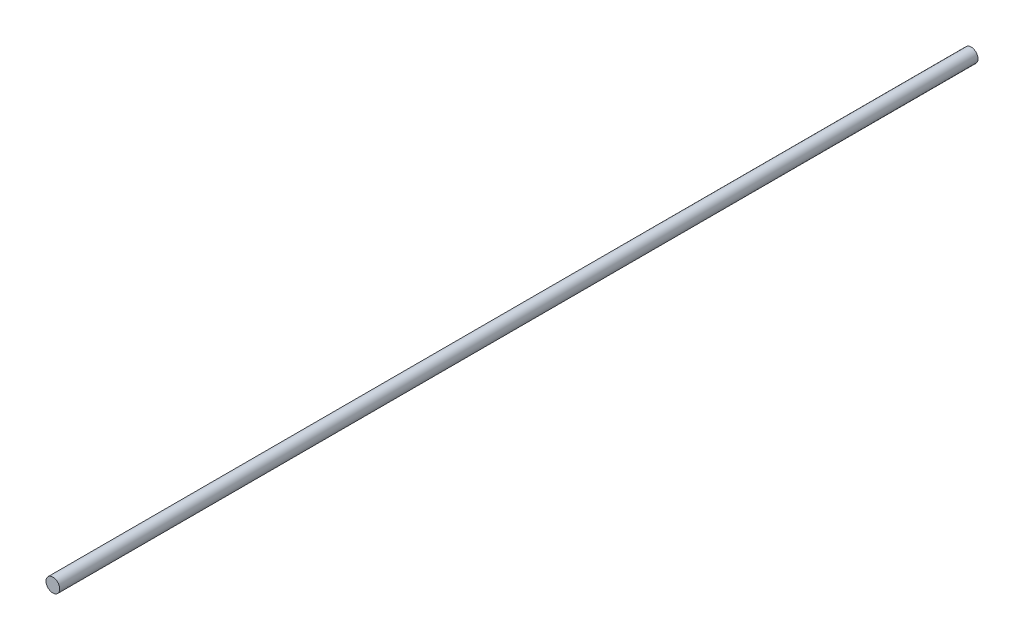
ISO-10303-21;
HEADER;
FILE_DESCRIPTION(('STEP AP214'),'2;1');
FILE_NAME('part.step','',(''),(''),'','','');
FILE_SCHEMA(('AUTOMOTIVE_DESIGN { 1 0 10303 214 1 1 1 1 }'));
ENDSEC;
DATA;
#1=APPLICATION_CONTEXT('core data for automotive mechanical design processes');
#2=APPLICATION_PROTOCOL_DEFINITION('international standard','automotive_design',2000,#1);
#3=PRODUCT_CONTEXT('',#1,'mechanical');
#4=PRODUCT('Part','Part','',(#3));
#5=PRODUCT_RELATED_PRODUCT_CATEGORY('part','',(#4));
#6=PRODUCT_DEFINITION_FORMATION('','',#4);
#7=PRODUCT_DEFINITION_CONTEXT('part definition',#1,'design');
#8=PRODUCT_DEFINITION('design','',#6,#7);
#9=PRODUCT_DEFINITION_SHAPE('','',#8);
#10=(LENGTH_UNIT() NAMED_UNIT(*) SI_UNIT(.MILLI.,.METRE.));
#11=(NAMED_UNIT(*) PLANE_ANGLE_UNIT() SI_UNIT($,.RADIAN.));
#12=(NAMED_UNIT(*) SI_UNIT($,.STERADIAN.) SOLID_ANGLE_UNIT());
#13=UNCERTAINTY_MEASURE_WITH_UNIT(LENGTH_MEASURE(1.E-05),#10,'distance_accuracy_value','');
#14=(GEOMETRIC_REPRESENTATION_CONTEXT(3) GLOBAL_UNCERTAINTY_ASSIGNED_CONTEXT((#13)) GLOBAL_UNIT_ASSIGNED_CONTEXT((#10,
#11,#12)) REPRESENTATION_CONTEXT('',''));
#15=CARTESIAN_POINT('',(0.,0.,0.));
#16=DIRECTION('',(0.,0.,1.));
#17=DIRECTION('',(1.,0.,0.));
#18=AXIS2_PLACEMENT_3D('',#15,#16,#17);
#19=CARTESIAN_POINT('',(0.,0.,100.));
#20=DIRECTION('',(0.,0.,-1.));
#21=DIRECTION('',(-1.,0.,0.));
#22=AXIS2_PLACEMENT_3D('',#19,#20,#21);
#23=CYLINDRICAL_SURFACE('',#22,0.750000000000001);
#24=CARTESIAN_POINT('',(0.,0.,100.));
#25=DIRECTION('',(0.,0.,1.));
#26=DIRECTION('',(1.,0.,0.));
#27=AXIS2_PLACEMENT_3D('',#24,#25,#26);
#28=CIRCLE('',#27,0.750000000000001);
#29=CARTESIAN_POINT('',(0.750000000000001,0.,100.));
#30=VERTEX_POINT('',#29);
#31=EDGE_CURVE('E10',#30,#30,#28,.T.);
#32=ORIENTED_EDGE('',*,*,#31,.F.);
#33=EDGE_LOOP('',(#32));
#34=FACE_BOUND('',#33,.T.);
#35=CARTESIAN_POINT('',(0.,0.,0.));
#36=DIRECTION('',(0.,0.,1.));
#37=DIRECTION('',(1.,0.,0.));
#38=AXIS2_PLACEMENT_3D('',#35,#36,#37);
#39=CIRCLE('',#38,0.750000000000001);
#40=CARTESIAN_POINT('',(0.750000000000001,0.,0.));
#41=VERTEX_POINT('',#40);
#42=EDGE_CURVE('E34',#41,#41,#39,.T.);
#43=ORIENTED_EDGE('',*,*,#42,.T.);
#44=EDGE_LOOP('',(#43));
#45=FACE_BOUND('',#44,.T.);
#46=ADVANCED_FACE('F31',(#34,#45),#23,.T.);
#47=CARTESIAN_POINT('',(0.,0.,100.));
#48=DIRECTION('',(0.,0.,1.));
#49=DIRECTION('',(1.,0.,0.));
#50=AXIS2_PLACEMENT_3D('',#47,#48,#49);
#51=PLANE('',#50);
#52=ORIENTED_EDGE('',*,*,#31,.T.);
#53=EDGE_LOOP('',(#52));
#54=FACE_BOUND('',#53,.T.);
#55=ADVANCED_FACE('F46',(#54),#51,.T.);
#56=CARTESIAN_POINT('',(0.,0.,0.));
#57=DIRECTION('',(0.,0.,1.));
#58=DIRECTION('',(1.,0.,0.));
#59=AXIS2_PLACEMENT_3D('',#56,#57,#58);
#60=PLANE('',#59);
#61=ORIENTED_EDGE('',*,*,#42,.F.);
#62=EDGE_LOOP('',(#61));
#63=FACE_BOUND('',#62,.T.);
#64=ADVANCED_FACE('F44',(#63),#60,.F.);
#65=CLOSED_SHELL('',(#46,#55,#64));
#66=MANIFOLD_SOLID_BREP('B2',#65);
#67=ADVANCED_BREP_SHAPE_REPRESENTATION('',(#18,#66),#14);
#68=SHAPE_DEFINITION_REPRESENTATION(#9,#67);
ENDSEC;
END-ISO-10303-21;
